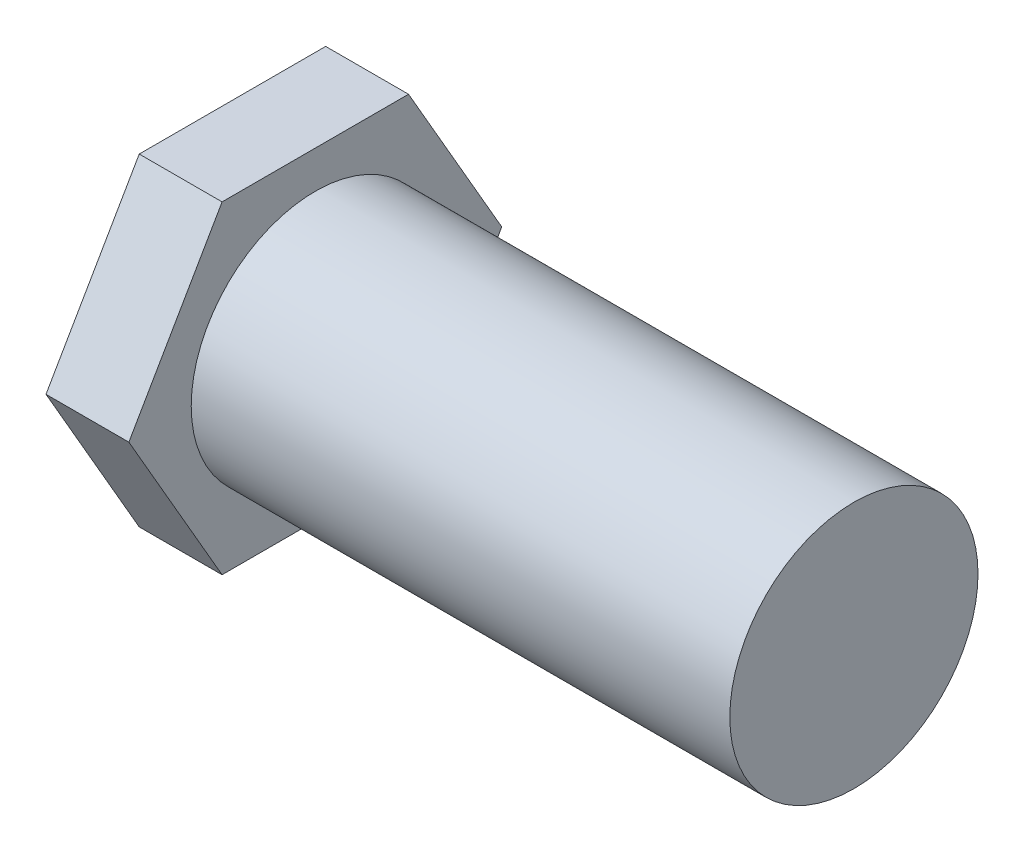
ISO-10303-21;
HEADER;
FILE_DESCRIPTION(('STEP AP214'),'2;1');
FILE_NAME('part.step','',(''),(''),'','','');
FILE_SCHEMA(('AUTOMOTIVE_DESIGN { 1 0 10303 214 1 1 1 1 }'));
ENDSEC;
DATA;
#1=APPLICATION_CONTEXT('core data for automotive mechanical design processes');
#2=APPLICATION_PROTOCOL_DEFINITION('international standard','automotive_design',2000,#1);
#3=PRODUCT_CONTEXT('',#1,'mechanical');
#4=PRODUCT('Part','Part','',(#3));
#5=PRODUCT_RELATED_PRODUCT_CATEGORY('part','',(#4));
#6=PRODUCT_DEFINITION_FORMATION('','',#4);
#7=PRODUCT_DEFINITION_CONTEXT('part definition',#1,'design');
#8=PRODUCT_DEFINITION('design','',#6,#7);
#9=PRODUCT_DEFINITION_SHAPE('','',#8);
#10=(LENGTH_UNIT() NAMED_UNIT(*) SI_UNIT(.MILLI.,.METRE.));
#11=(NAMED_UNIT(*) PLANE_ANGLE_UNIT() SI_UNIT($,.RADIAN.));
#12=(NAMED_UNIT(*) SI_UNIT($,.STERADIAN.) SOLID_ANGLE_UNIT());
#13=UNCERTAINTY_MEASURE_WITH_UNIT(LENGTH_MEASURE(1.E-05),#10,'distance_accuracy_value','');
#14=(GEOMETRIC_REPRESENTATION_CONTEXT(3) GLOBAL_UNCERTAINTY_ASSIGNED_CONTEXT((#13)) GLOBAL_UNIT_ASSIGNED_CONTEXT((#10,
#11,#12)) REPRESENTATION_CONTEXT('',''));
#15=CARTESIAN_POINT('',(0.,0.,0.));
#16=DIRECTION('',(0.,0.,1.));
#17=DIRECTION('',(1.,0.,0.));
#18=AXIS2_PLACEMENT_3D('',#15,#16,#17);
#19=CARTESIAN_POINT('',(130.,0.,0.));
#20=DIRECTION('',(-1.,0.,0.));
#21=DIRECTION('',(0.,0.,1.));
#22=AXIS2_PLACEMENT_3D('',#19,#20,#21);
#23=CYLINDRICAL_SURFACE('',#22,29.95);
#24=CARTESIAN_POINT('',(130.,0.,0.));
#25=DIRECTION('',(1.,0.,0.));
#26=DIRECTION('',(0.,0.,-1.));
#27=AXIS2_PLACEMENT_3D('',#24,#25,#26);
#28=CIRCLE('',#27,29.95);
#29=CARTESIAN_POINT('',(130.,0.,-29.95));
#30=VERTEX_POINT('',#29);
#31=EDGE_CURVE('E11',#30,#30,#28,.T.);
#32=ORIENTED_EDGE('',*,*,#31,.F.);
#33=EDGE_LOOP('',(#32));
#34=FACE_BOUND('',#33,.T.);
#35=CARTESIAN_POINT('',(0.,0.,0.));
#36=DIRECTION('',(-1.,0.,0.));
#37=DIRECTION('',(0.,0.,1.));
#38=AXIS2_PLACEMENT_3D('',#35,#36,#37);
#39=CIRCLE('',#38,29.95);
#40=CARTESIAN_POINT('',(0.,0.,29.95));
#41=VERTEX_POINT('',#40);
#42=EDGE_CURVE('E43',#41,#41,#39,.T.);
#43=ORIENTED_EDGE('',*,*,#42,.F.);
#44=EDGE_LOOP('',(#43));
#45=FACE_BOUND('',#44,.T.);
#46=ADVANCED_FACE('F35',(#34,#45),#23,.T.);
#47=CARTESIAN_POINT('',(130.,0.,0.));
#48=DIRECTION('',(1.,0.,0.));
#49=DIRECTION('',(0.,0.,-1.));
#50=AXIS2_PLACEMENT_3D('',#47,#48,#49);
#51=PLANE('',#50);
#52=ORIENTED_EDGE('',*,*,#31,.T.);
#53=EDGE_LOOP('',(#52));
#54=FACE_BOUND('',#53,.T.);
#55=ADVANCED_FACE('F144',(#54),#51,.T.);
#56=CARTESIAN_POINT('',(0.,0.,0.));
#57=DIRECTION('',(-1.,0.,0.));
#58=DIRECTION('',(0.,0.,1.));
#59=AXIS2_PLACEMENT_3D('',#56,#57,#58);
#60=PLANE('',#59);
#61=DIRECTION('',(0.,0.866025403784439,0.5));
#62=VECTOR('',#61,1.);
#63=CARTESIAN_POINT('',(0.,-38.9711431702998,22.5));
#64=LINE('',#63,#62);
#65=CARTESIAN_POINT('',(0.,-38.9711431702998,22.5));
#66=VERTEX_POINT('',#65);
#67=CARTESIAN_POINT('',(0.,0.,45.));
#68=VERTEX_POINT('',#67);
#69=EDGE_CURVE('E120',#66,#68,#64,.T.);
#70=ORIENTED_EDGE('',*,*,#69,.F.);
#71=DIRECTION('',(0.,0.,1.));
#72=VECTOR('',#71,1.);
#73=CARTESIAN_POINT('',(0.,-38.9711431702998,-22.5));
#74=LINE('',#73,#72);
#75=CARTESIAN_POINT('',(0.,-38.9711431702998,-22.5));
#76=VERTEX_POINT('',#75);
#77=EDGE_CURVE('E80',#76,#66,#74,.T.);
#78=ORIENTED_EDGE('',*,*,#77,.F.);
#79=DIRECTION('',(0.,-0.866025403784439,0.5));
#80=VECTOR('',#79,1.);
#81=CARTESIAN_POINT('',(0.,0.,-45.));
#82=LINE('',#81,#80);
#83=CARTESIAN_POINT('',(0.,0.,-45.));
#84=VERTEX_POINT('',#83);
#85=EDGE_CURVE('E74',#84,#76,#82,.T.);
#86=ORIENTED_EDGE('',*,*,#85,.F.);
#87=DIRECTION('',(0.,-0.866025403784439,-0.5));
#88=VECTOR('',#87,1.);
#89=CARTESIAN_POINT('',(0.,38.9711431702998,-22.5));
#90=LINE('',#89,#88);
#91=CARTESIAN_POINT('',(0.,38.9711431702998,-22.5));
#92=VERTEX_POINT('',#91);
#93=EDGE_CURVE('E110',#92,#84,#90,.T.);
#94=ORIENTED_EDGE('',*,*,#93,.F.);
#95=DIRECTION('',(0.,0.,-1.));
#96=VECTOR('',#95,1.);
#97=CARTESIAN_POINT('',(0.,38.9711431702998,22.5));
#98=LINE('',#97,#96);
#99=CARTESIAN_POINT('',(0.,38.9711431702998,22.5));
#100=VERTEX_POINT('',#99);
#101=EDGE_CURVE('E125',#100,#92,#98,.T.);
#102=ORIENTED_EDGE('',*,*,#101,.F.);
#103=DIRECTION('',(0.,0.866025403784439,-0.5));
#104=VECTOR('',#103,1.);
#105=CARTESIAN_POINT('',(0.,0.,45.));
#106=LINE('',#105,#104);
#107=EDGE_CURVE('E123',#68,#100,#106,.T.);
#108=ORIENTED_EDGE('',*,*,#107,.F.);
#109=EDGE_LOOP('',(#70,#78,#86,#94,#102,#108));
#110=FACE_BOUND('',#109,.T.);
#111=ORIENTED_EDGE('',*,*,#42,.T.);
#112=EDGE_LOOP('',(#111));
#113=FACE_BOUND('',#112,.T.);
#114=ADVANCED_FACE('F141',(#110,#113),#60,.F.);
#115=CARTESIAN_POINT('',(-20.,-38.9711431702998,22.5));
#116=DIRECTION('',(0.,0.5,-0.866025403784439));
#117=DIRECTION('',(0.,0.866025403784439,0.5));
#118=AXIS2_PLACEMENT_3D('',#115,#116,#117);
#119=PLANE('',#118);
#120=ORIENTED_EDGE('',*,*,#69,.T.);
#121=DIRECTION('',(1.,0.,0.));
#122=VECTOR('',#121,1.);
#123=CARTESIAN_POINT('',(-20.,0.,45.));
#124=LINE('',#123,#122);
#125=CARTESIAN_POINT('',(-20.,0.,45.));
#126=VERTEX_POINT('',#125);
#127=EDGE_CURVE('E137',#126,#68,#124,.T.);
#128=ORIENTED_EDGE('',*,*,#127,.F.);
#129=DIRECTION('',(0.,0.866025403784439,0.5));
#130=VECTOR('',#129,1.);
#131=CARTESIAN_POINT('',(-20.,-38.9711431702998,22.5));
#132=LINE('',#131,#130);
#133=CARTESIAN_POINT('',(-20.,-38.9711431702998,22.5));
#134=VERTEX_POINT('',#133);
#135=EDGE_CURVE('E130',#134,#126,#132,.T.);
#136=ORIENTED_EDGE('',*,*,#135,.F.);
#137=DIRECTION('',(1.,0.,0.));
#138=VECTOR('',#137,1.);
#139=CARTESIAN_POINT('',(-20.,-38.9711431702998,22.5));
#140=LINE('',#139,#138);
#141=EDGE_CURVE('E116',#134,#66,#140,.T.);
#142=ORIENTED_EDGE('',*,*,#141,.T.);
#143=EDGE_LOOP('',(#120,#128,#136,#142));
#144=FACE_BOUND('',#143,.T.);
#145=ADVANCED_FACE('F154',(#144),#119,.F.);
#146=CARTESIAN_POINT('',(-20.,0.,45.));
#147=DIRECTION('',(0.,-0.5,-0.866025403784438));
#148=DIRECTION('',(0.,0.866025403784439,-0.5));
#149=AXIS2_PLACEMENT_3D('',#146,#147,#148);
#150=PLANE('',#149);
#151=ORIENTED_EDGE('',*,*,#107,.T.);
#152=DIRECTION('',(1.,0.,0.));
#153=VECTOR('',#152,1.);
#154=CARTESIAN_POINT('',(-20.,38.9711431702998,22.5));
#155=LINE('',#154,#153);
#156=CARTESIAN_POINT('',(-20.,38.9711431702998,22.5));
#157=VERTEX_POINT('',#156);
#158=EDGE_CURVE('E134',#157,#100,#155,.T.);
#159=ORIENTED_EDGE('',*,*,#158,.F.);
#160=DIRECTION('',(0.,0.866025403784439,-0.5));
#161=VECTOR('',#160,1.);
#162=CARTESIAN_POINT('',(-20.,0.,45.));
#163=LINE('',#162,#161);
#164=EDGE_CURVE('E89',#126,#157,#163,.T.);
#165=ORIENTED_EDGE('',*,*,#164,.F.);
#166=ORIENTED_EDGE('',*,*,#127,.T.);
#167=EDGE_LOOP('',(#151,#159,#165,#166));
#168=FACE_BOUND('',#167,.T.);
#169=ADVANCED_FACE('F160',(#168),#150,.F.);
#170=CARTESIAN_POINT('',(-20.,38.9711431702998,22.5));
#171=DIRECTION('',(0.,-1.,0.));
#172=DIRECTION('',(0.,0.,-1.));
#173=AXIS2_PLACEMENT_3D('',#170,#171,#172);
#174=PLANE('',#173);
#175=ORIENTED_EDGE('',*,*,#101,.T.);
#176=DIRECTION('',(1.,0.,0.));
#177=VECTOR('',#176,1.);
#178=CARTESIAN_POINT('',(-20.,38.9711431702998,-22.5));
#179=LINE('',#178,#177);
#180=CARTESIAN_POINT('',(-20.,38.9711431702998,-22.5));
#181=VERTEX_POINT('',#180);
#182=EDGE_CURVE('E111',#181,#92,#179,.T.);
#183=ORIENTED_EDGE('',*,*,#182,.F.);
#184=DIRECTION('',(0.,0.,-1.));
#185=VECTOR('',#184,1.);
#186=CARTESIAN_POINT('',(-20.,38.9711431702998,22.5));
#187=LINE('',#186,#185);
#188=EDGE_CURVE('E102',#157,#181,#187,.T.);
#189=ORIENTED_EDGE('',*,*,#188,.F.);
#190=ORIENTED_EDGE('',*,*,#158,.T.);
#191=EDGE_LOOP('',(#175,#183,#189,#190));
#192=FACE_BOUND('',#191,.T.);
#193=ADVANCED_FACE('F164',(#192),#174,.F.);
#194=CARTESIAN_POINT('',(-20.,38.9711431702998,-22.5));
#195=DIRECTION('',(0.,-0.5,0.866025403784439));
#196=DIRECTION('',(0.,-0.866025403784439,-0.5));
#197=AXIS2_PLACEMENT_3D('',#194,#195,#196);
#198=PLANE('',#197);
#199=ORIENTED_EDGE('',*,*,#93,.T.);
#200=DIRECTION('',(1.,0.,0.));
#201=VECTOR('',#200,1.);
#202=CARTESIAN_POINT('',(-20.,0.,-45.));
#203=LINE('',#202,#201);
#204=CARTESIAN_POINT('',(-20.,0.,-45.));
#205=VERTEX_POINT('',#204);
#206=EDGE_CURVE('E107',#205,#84,#203,.T.);
#207=ORIENTED_EDGE('',*,*,#206,.F.);
#208=DIRECTION('',(0.,-0.866025403784439,-0.5));
#209=VECTOR('',#208,1.);
#210=CARTESIAN_POINT('',(-20.,38.9711431702998,-22.5));
#211=LINE('',#210,#209);
#212=EDGE_CURVE('E96',#181,#205,#211,.T.);
#213=ORIENTED_EDGE('',*,*,#212,.F.);
#214=ORIENTED_EDGE('',*,*,#182,.T.);
#215=EDGE_LOOP('',(#199,#207,#213,#214));
#216=FACE_BOUND('',#215,.T.);
#217=ADVANCED_FACE('F108',(#216),#198,.F.);
#218=CARTESIAN_POINT('',(-20.,0.,-45.));
#219=DIRECTION('',(0.,0.5,0.866025403784439));
#220=DIRECTION('',(0.,-0.866025403784439,0.5));
#221=AXIS2_PLACEMENT_3D('',#218,#219,#220);
#222=PLANE('',#221);
#223=ORIENTED_EDGE('',*,*,#85,.T.);
#224=DIRECTION('',(1.,0.,0.));
#225=VECTOR('',#224,1.);
#226=CARTESIAN_POINT('',(-20.,-38.9711431702998,-22.5));
#227=LINE('',#226,#225);
#228=CARTESIAN_POINT('',(-20.,-38.9711431702998,-22.5));
#229=VERTEX_POINT('',#228);
#230=EDGE_CURVE('E112',#229,#76,#227,.T.);
#231=ORIENTED_EDGE('',*,*,#230,.F.);
#232=DIRECTION('',(0.,-0.866025403784439,0.5));
#233=VECTOR('',#232,1.);
#234=CARTESIAN_POINT('',(-20.,0.,-45.));
#235=LINE('',#234,#233);
#236=EDGE_CURVE('E100',#205,#229,#235,.T.);
#237=ORIENTED_EDGE('',*,*,#236,.F.);
#238=ORIENTED_EDGE('',*,*,#206,.T.);
#239=EDGE_LOOP('',(#223,#231,#237,#238));
#240=FACE_BOUND('',#239,.T.);
#241=ADVANCED_FACE('F114',(#240),#222,.F.);
#242=CARTESIAN_POINT('',(-20.,-38.9711431702998,-22.5));
#243=DIRECTION('',(0.,1.,0.));
#244=DIRECTION('',(0.,0.,1.));
#245=AXIS2_PLACEMENT_3D('',#242,#243,#244);
#246=PLANE('',#245);
#247=ORIENTED_EDGE('',*,*,#77,.T.);
#248=ORIENTED_EDGE('',*,*,#141,.F.);
#249=DIRECTION('',(0.,0.,1.));
#250=VECTOR('',#249,1.);
#251=CARTESIAN_POINT('',(-20.,-38.9711431702998,-22.5));
#252=LINE('',#251,#250);
#253=EDGE_CURVE('E51',#229,#134,#252,.T.);
#254=ORIENTED_EDGE('',*,*,#253,.F.);
#255=ORIENTED_EDGE('',*,*,#230,.T.);
#256=EDGE_LOOP('',(#247,#248,#254,#255));
#257=FACE_BOUND('',#256,.T.);
#258=ADVANCED_FACE('F172',(#257),#246,.F.);
#259=CARTESIAN_POINT('',(-20.,0.,0.));
#260=DIRECTION('',(-1.,0.,0.));
#261=DIRECTION('',(0.,0.,1.));
#262=AXIS2_PLACEMENT_3D('',#259,#260,#261);
#263=PLANE('',#262);
#264=ORIENTED_EDGE('',*,*,#135,.T.);
#265=ORIENTED_EDGE('',*,*,#164,.T.);
#266=ORIENTED_EDGE('',*,*,#188,.T.);
#267=ORIENTED_EDGE('',*,*,#212,.T.);
#268=ORIENTED_EDGE('',*,*,#236,.T.);
#269=ORIENTED_EDGE('',*,*,#253,.T.);
#270=EDGE_LOOP('',(#264,#265,#266,#267,#268,#269));
#271=FACE_BOUND('',#270,.T.);
#272=ADVANCED_FACE('F98',(#271),#263,.T.);
#273=CLOSED_SHELL('',(#46,#55,#114,#145,#169,#193,#217,#241,#258,#272));
#274=MANIFOLD_SOLID_BREP('B2',#273);
#275=ADVANCED_BREP_SHAPE_REPRESENTATION('',(#18,#274),#14);
#276=SHAPE_DEFINITION_REPRESENTATION(#9,#275);
ENDSEC;
END-ISO-10303-21;
